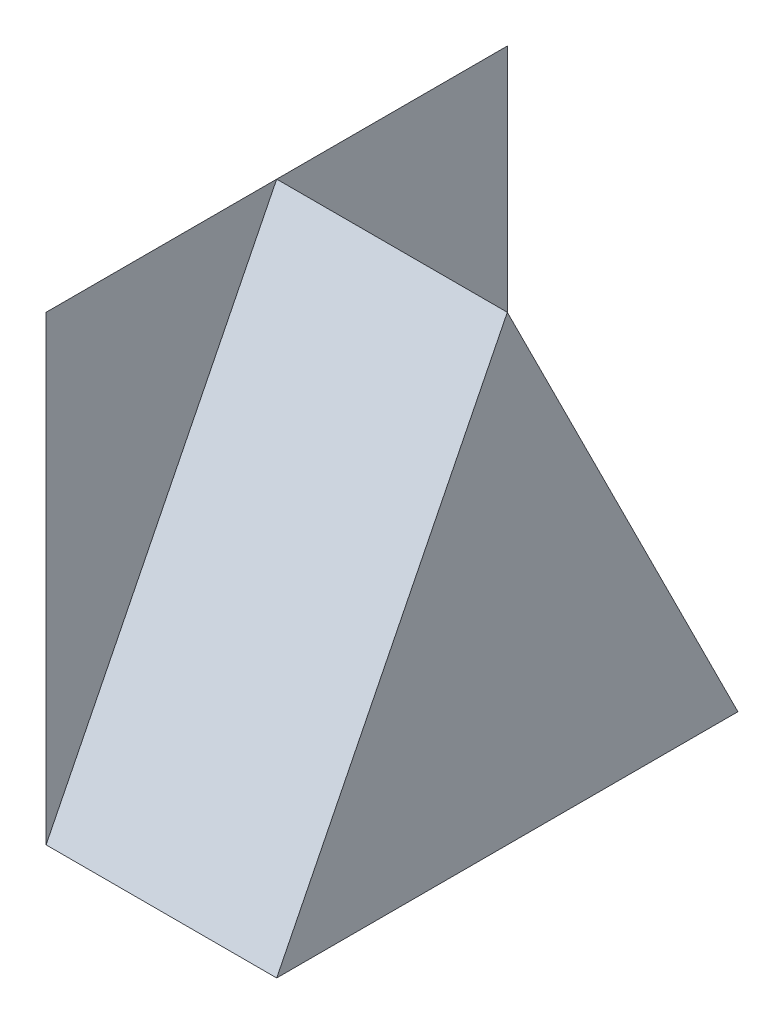
ISO-10303-21;
HEADER;
FILE_DESCRIPTION(('STEP AP214'),'2;1');
FILE_NAME('part.step','',(''),(''),'','','');
FILE_SCHEMA(('AUTOMOTIVE_DESIGN { 1 0 10303 214 1 1 1 1 }'));
ENDSEC;
DATA;
#1=APPLICATION_CONTEXT('core data for automotive mechanical design processes');
#2=APPLICATION_PROTOCOL_DEFINITION('international standard','automotive_design',2000,#1);
#3=PRODUCT_CONTEXT('',#1,'mechanical');
#4=PRODUCT('Part','Part','',(#3));
#5=PRODUCT_RELATED_PRODUCT_CATEGORY('part','',(#4));
#6=PRODUCT_DEFINITION_FORMATION('','',#4);
#7=PRODUCT_DEFINITION_CONTEXT('part definition',#1,'design');
#8=PRODUCT_DEFINITION('design','',#6,#7);
#9=PRODUCT_DEFINITION_SHAPE('','',#8);
#10=(LENGTH_UNIT() NAMED_UNIT(*) SI_UNIT(.MILLI.,.METRE.));
#11=(NAMED_UNIT(*) PLANE_ANGLE_UNIT() SI_UNIT($,.RADIAN.));
#12=(NAMED_UNIT(*) SI_UNIT($,.STERADIAN.) SOLID_ANGLE_UNIT());
#13=UNCERTAINTY_MEASURE_WITH_UNIT(LENGTH_MEASURE(1.E-05),#10,'distance_accuracy_value','');
#14=(GEOMETRIC_REPRESENTATION_CONTEXT(3) GLOBAL_UNCERTAINTY_ASSIGNED_CONTEXT((#13)) GLOBAL_UNIT_ASSIGNED_CONTEXT((#10,
#11,#12)) REPRESENTATION_CONTEXT('',''));
#15=CARTESIAN_POINT('',(0.,0.,0.));
#16=DIRECTION('',(0.,0.,1.));
#17=DIRECTION('',(1.,0.,0.));
#18=AXIS2_PLACEMENT_3D('',#15,#16,#17);
#19=CARTESIAN_POINT('',(0.,0.,40.));
#20=DIRECTION('',(0.,1.,0.));
#21=DIRECTION('',(0.,0.,1.));
#22=AXIS2_PLACEMENT_3D('',#19,#20,#21);
#23=PLANE('',#22);
#24=DIRECTION('',(-0.707106781186548,0.,-0.707106781186548));
#25=VECTOR('',#24,1.);
#26=CARTESIAN_POINT('',(-10.,0.,10.));
#27=LINE('',#26,#25);
#28=CARTESIAN_POINT('',(20.,0.,40.));
#29=VERTEX_POINT('',#28);
#30=CARTESIAN_POINT('',(0.000100000000001141,0.,20.0001));
#31=VERTEX_POINT('',#30);
#32=EDGE_CURVE('E147',#29,#31,#27,.T.);
#33=ORIENTED_EDGE('',*,*,#32,.T.);
#34=DIRECTION('',(-1.,0.,0.));
#35=VECTOR('',#34,1.);
#36=CARTESIAN_POINT('',(0.,0.,20.0001));
#37=LINE('',#36,#35);
#38=CARTESIAN_POINT('',(21.9656812601414,0.,20.0001));
#39=VERTEX_POINT('',#38);
#40=EDGE_CURVE('E49',#39,#31,#37,.T.);
#41=ORIENTED_EDGE('',*,*,#40,.F.);
#42=DIRECTION('',(0.,0.,1.));
#43=VECTOR('',#42,1.);
#44=CARTESIAN_POINT('',(21.9656812601414,0.,20.));
#45=LINE('',#44,#43);
#46=CARTESIAN_POINT('',(21.9656812601414,0.,20.));
#47=VERTEX_POINT('',#46);
#48=EDGE_CURVE('E130',#47,#39,#45,.T.);
#49=ORIENTED_EDGE('',*,*,#48,.F.);
#50=DIRECTION('',(1.,0.,0.));
#51=VECTOR('',#50,1.);
#52=CARTESIAN_POINT('',(0.,0.,20.));
#53=LINE('',#52,#51);
#54=CARTESIAN_POINT('',(0.,0.,20.));
#55=VERTEX_POINT('',#54);
#56=EDGE_CURVE('E118',#55,#47,#53,.T.);
#57=ORIENTED_EDGE('',*,*,#56,.F.);
#58=DIRECTION('',(0.707106781186548,0.,-0.707106781186548));
#59=VECTOR('',#58,1.);
#60=CARTESIAN_POINT('',(10.,0.,10.));
#61=LINE('',#60,#59);
#62=CARTESIAN_POINT('',(20.,0.,0.));
#63=VERTEX_POINT('',#62);
#64=EDGE_CURVE('E160',#55,#63,#61,.T.);
#65=ORIENTED_EDGE('',*,*,#64,.T.);
#66=DIRECTION('',(1.,0.,0.));
#67=VECTOR('',#66,1.);
#68=CARTESIAN_POINT('',(0.,0.,0.));
#69=LINE('',#68,#67);
#70=CARTESIAN_POINT('',(40.,0.,0.));
#71=VERTEX_POINT('',#70);
#72=EDGE_CURVE('E169',#63,#71,#69,.T.);
#73=ORIENTED_EDGE('',*,*,#72,.T.);
#74=DIRECTION('',(0.,0.,-1.));
#75=VECTOR('',#74,1.);
#76=CARTESIAN_POINT('',(40.,0.,40.));
#77=LINE('',#76,#75);
#78=CARTESIAN_POINT('',(40.,0.,40.));
#79=VERTEX_POINT('',#78);
#80=EDGE_CURVE('E172',#79,#71,#77,.T.);
#81=ORIENTED_EDGE('',*,*,#80,.F.);
#82=DIRECTION('',(1.,0.,0.));
#83=VECTOR('',#82,1.);
#84=CARTESIAN_POINT('',(0.,0.,40.));
#85=LINE('',#84,#83);
#86=EDGE_CURVE('E170',#29,#79,#85,.T.);
#87=ORIENTED_EDGE('',*,*,#86,.F.);
#88=EDGE_LOOP('',(#33,#41,#49,#57,#65,#73,#81,#87));
#89=FACE_BOUND('',#88,.T.);
#90=ADVANCED_FACE('F35',(#89),#23,.F.);
#91=CARTESIAN_POINT('',(0.,0.,0.));
#92=DIRECTION('',(0.894427190999916,-0.447213595499958,0.));
#93=DIRECTION('',(0.447213595499958,0.894427190999916,0.));
#94=AXIS2_PLACEMENT_3D('',#91,#92,#93);
#95=PLANE('',#94);
#96=DIRECTION('',(0.,0.,1.));
#97=VECTOR('',#96,1.);
#98=CARTESIAN_POINT('',(0.0005,0.001,0.));
#99=LINE('',#98,#97);
#100=CARTESIAN_POINT('',(0.0005,0.001,20.));
#101=VERTEX_POINT('',#100);
#102=CARTESIAN_POINT('',(0.0005,0.001,20.0001));
#103=VERTEX_POINT('',#102);
#104=EDGE_CURVE('E12',#101,#103,#99,.T.);
#105=ORIENTED_EDGE('',*,*,#104,.T.);
#106=DIRECTION('',(-0.447213595499958,-0.894427190999916,0.));
#107=VECTOR('',#106,1.);
#108=CARTESIAN_POINT('',(0.,0.,20.0001));
#109=LINE('',#108,#107);
#110=CARTESIAN_POINT('',(9.99999999920335E-05,0.000199999999977128,20.0001));
#111=VERTEX_POINT('',#110);
#112=EDGE_CURVE('E136',#103,#111,#109,.T.);
#113=ORIENTED_EDGE('',*,*,#112,.T.);
#114=DIRECTION('',(-0.408248290463863,-0.816496580927726,-0.408248290463863));
#115=VECTOR('',#114,1.);
#116=CARTESIAN_POINT('',(-3.33333333333333,-6.66666666666667,16.6666666666667));
#117=LINE('',#116,#115);
#118=CARTESIAN_POINT('',(20.,40.,40.));
#119=VERTEX_POINT('',#118);
#120=EDGE_CURVE('E155',#119,#111,#117,.T.);
#121=ORIENTED_EDGE('',*,*,#120,.F.);
#122=DIRECTION('',(0.,0.,1.));
#123=VECTOR('',#122,1.);
#124=CARTESIAN_POINT('',(20.,40.,0.));
#125=LINE('',#124,#123);
#126=CARTESIAN_POINT('',(20.,40.,20.));
#127=VERTEX_POINT('',#126);
#128=EDGE_CURVE('E57',#127,#119,#125,.T.);
#129=ORIENTED_EDGE('',*,*,#128,.F.);
#130=DIRECTION('',(0.,0.,1.));
#131=VECTOR('',#130,1.);
#132=CARTESIAN_POINT('',(20.,40.,0.));
#133=LINE('',#132,#131);
#134=CARTESIAN_POINT('',(20.,40.,0.));
#135=VERTEX_POINT('',#134);
#136=EDGE_CURVE('E166',#135,#127,#133,.T.);
#137=ORIENTED_EDGE('',*,*,#136,.F.);
#138=DIRECTION('',(0.408248290463863,0.816496580927726,-0.408248290463863));
#139=VECTOR('',#138,1.);
#140=CARTESIAN_POINT('',(3.33333333333333,6.66666666666667,16.6666666666667));
#141=LINE('',#140,#139);
#142=EDGE_CURVE('E177',#55,#135,#141,.T.);
#143=ORIENTED_EDGE('',*,*,#142,.F.);
#144=DIRECTION('',(0.447213595499958,0.894427190999916,0.));
#145=VECTOR('',#144,1.);
#146=CARTESIAN_POINT('',(0.,0.,20.));
#147=LINE('',#146,#145);
#148=EDGE_CURVE('E133',#55,#101,#147,.T.);
#149=ORIENTED_EDGE('',*,*,#148,.T.);
#150=EDGE_LOOP('',(#105,#113,#121,#129,#137,#143,#149));
#151=FACE_BOUND('',#150,.T.);
#152=ADVANCED_FACE('F184',(#151),#95,.F.);
#153=CARTESIAN_POINT('',(40.,0.,40.));
#154=DIRECTION('',(-1.,0.,0.));
#155=DIRECTION('',(0.,0.,1.));
#156=AXIS2_PLACEMENT_3D('',#153,#154,#155);
#157=PLANE('',#156);
#158=ORIENTED_EDGE('',*,*,#80,.T.);
#159=DIRECTION('',(0.,-0.894427190999916,-0.447213595499958));
#160=VECTOR('',#159,1.);
#161=CARTESIAN_POINT('',(40.,0.,0.));
#162=LINE('',#161,#160);
#163=CARTESIAN_POINT('',(40.,40.,20.));
#164=VERTEX_POINT('',#163);
#165=EDGE_CURVE('E142',#164,#71,#162,.T.);
#166=ORIENTED_EDGE('',*,*,#165,.F.);
#167=DIRECTION('',(0.,0.894427190999916,-0.447213595499958));
#168=VECTOR('',#167,1.);
#169=CARTESIAN_POINT('',(40.,16.,32.));
#170=LINE('',#169,#168);
#171=EDGE_CURVE('E144',#79,#164,#170,.T.);
#172=ORIENTED_EDGE('',*,*,#171,.F.);
#173=EDGE_LOOP('',(#158,#166,#172));
#174=FACE_BOUND('',#173,.T.);
#175=ADVANCED_FACE('F200',(#174),#157,.F.);
#176=CARTESIAN_POINT('',(10.,40.,10.));
#177=DIRECTION('',(-0.707106781186548,0.,-0.707106781186548));
#178=DIRECTION('',(-0.707106781186548,0.,0.707106781186548));
#179=AXIS2_PLACEMENT_3D('',#176,#177,#178);
#180=PLANE('',#179);
#181=ORIENTED_EDGE('',*,*,#142,.T.);
#182=DIRECTION('',(0.,-1.,0.));
#183=VECTOR('',#182,1.);
#184=CARTESIAN_POINT('',(20.,40.,0.));
#185=LINE('',#184,#183);
#186=EDGE_CURVE('E163',#135,#63,#185,.T.);
#187=ORIENTED_EDGE('',*,*,#186,.T.);
#188=ORIENTED_EDGE('',*,*,#64,.F.);
#189=EDGE_LOOP('',(#181,#187,#188));
#190=FACE_BOUND('',#189,.T.);
#191=ADVANCED_FACE('F205',(#190),#180,.T.);
#192=CARTESIAN_POINT('',(-10.,40.,10.));
#193=DIRECTION('',(-0.707106781186548,0.,0.707106781186548));
#194=DIRECTION('',(0.707106781186548,0.,0.707106781186548));
#195=AXIS2_PLACEMENT_3D('',#192,#193,#194);
#196=PLANE('',#195);
#197=DIRECTION('',(0.,1.,0.));
#198=VECTOR('',#197,1.);
#199=CARTESIAN_POINT('',(9.99999999959367E-05,40.,20.0001));
#200=LINE('',#199,#198);
#201=EDGE_CURVE('E42',#31,#111,#200,.T.);
#202=ORIENTED_EDGE('',*,*,#201,.F.);
#203=ORIENTED_EDGE('',*,*,#32,.F.);
#204=DIRECTION('',(0.,-1.,0.));
#205=VECTOR('',#204,1.);
#206=CARTESIAN_POINT('',(20.,40.,40.));
#207=LINE('',#206,#205);
#208=EDGE_CURVE('E153',#119,#29,#207,.T.);
#209=ORIENTED_EDGE('',*,*,#208,.F.);
#210=ORIENTED_EDGE('',*,*,#120,.T.);
#211=EDGE_LOOP('',(#202,#203,#209,#210));
#212=FACE_BOUND('',#211,.T.);
#213=ADVANCED_FACE('F185',(#212),#196,.T.);
#214=CARTESIAN_POINT('',(20.,16.,32.));
#215=DIRECTION('',(0.,-0.447213595499958,-0.894427190999916));
#216=DIRECTION('',(0.,0.894427190999916,-0.447213595499958));
#217=AXIS2_PLACEMENT_3D('',#214,#215,#216);
#218=PLANE('',#217);
#219=ORIENTED_EDGE('',*,*,#171,.T.);
#220=DIRECTION('',(1.,0.,0.));
#221=VECTOR('',#220,1.);
#222=CARTESIAN_POINT('',(20.,40.,20.));
#223=LINE('',#222,#221);
#224=EDGE_CURVE('E145',#127,#164,#223,.T.);
#225=ORIENTED_EDGE('',*,*,#224,.F.);
#226=DIRECTION('',(0.,0.894427190999916,-0.447213595499958));
#227=VECTOR('',#226,1.);
#228=CARTESIAN_POINT('',(20.,16.,32.));
#229=LINE('',#228,#227);
#230=EDGE_CURVE('E148',#29,#127,#229,.T.);
#231=ORIENTED_EDGE('',*,*,#230,.F.);
#232=ORIENTED_EDGE('',*,*,#86,.T.);
#233=EDGE_LOOP('',(#219,#225,#231,#232));
#234=FACE_BOUND('',#233,.T.);
#235=ADVANCED_FACE('F194',(#234),#218,.F.);
#236=CARTESIAN_POINT('',(20.,0.,0.));
#237=DIRECTION('',(1.,0.,0.));
#238=DIRECTION('',(0.,0.,-1.));
#239=AXIS2_PLACEMENT_3D('',#236,#237,#238);
#240=PLANE('',#239);
#241=ORIENTED_EDGE('',*,*,#208,.T.);
#242=ORIENTED_EDGE('',*,*,#230,.T.);
#243=ORIENTED_EDGE('',*,*,#128,.T.);
#244=EDGE_LOOP('',(#241,#242,#243));
#245=FACE_BOUND('',#244,.T.);
#246=ADVANCED_FACE('F187',(#245),#240,.T.);
#247=CARTESIAN_POINT('',(20.,0.,0.));
#248=DIRECTION('',(0.,-0.447213595499958,0.894427190999916));
#249=DIRECTION('',(0.,-0.894427190999916,-0.447213595499958));
#250=AXIS2_PLACEMENT_3D('',#247,#248,#249);
#251=PLANE('',#250);
#252=ORIENTED_EDGE('',*,*,#165,.T.);
#253=ORIENTED_EDGE('',*,*,#72,.F.);
#254=DIRECTION('',(0.,-0.894427190999916,-0.447213595499958));
#255=VECTOR('',#254,1.);
#256=CARTESIAN_POINT('',(20.,0.,0.));
#257=LINE('',#256,#255);
#258=EDGE_CURVE('E139',#127,#63,#257,.T.);
#259=ORIENTED_EDGE('',*,*,#258,.F.);
#260=ORIENTED_EDGE('',*,*,#224,.T.);
#261=EDGE_LOOP('',(#252,#253,#259,#260));
#262=FACE_BOUND('',#261,.T.);
#263=ADVANCED_FACE('F198',(#262),#251,.F.);
#264=CARTESIAN_POINT('',(20.,0.,0.));
#265=DIRECTION('',(1.,0.,0.));
#266=DIRECTION('',(0.,0.,-1.));
#267=AXIS2_PLACEMENT_3D('',#264,#265,#266);
#268=PLANE('',#267);
#269=ORIENTED_EDGE('',*,*,#136,.T.);
#270=ORIENTED_EDGE('',*,*,#258,.T.);
#271=ORIENTED_EDGE('',*,*,#186,.F.);
#272=EDGE_LOOP('',(#269,#270,#271));
#273=FACE_BOUND('',#272,.T.);
#274=ADVANCED_FACE('F193',(#273),#268,.T.);
#275=CARTESIAN_POINT('',(0.,0.001,0.));
#276=DIRECTION('',(0.,1.,0.));
#277=DIRECTION('',(0.,0.,1.));
#278=AXIS2_PLACEMENT_3D('',#275,#276,#277);
#279=PLANE('',#278);
#280=DIRECTION('',(1.,0.,0.));
#281=VECTOR('',#280,1.);
#282=CARTESIAN_POINT('',(0.,0.001,20.));
#283=LINE('',#282,#281);
#284=CARTESIAN_POINT('',(21.9656812601414,0.001,20.));
#285=VERTEX_POINT('',#284);
#286=EDGE_CURVE('E104',#101,#285,#283,.T.);
#287=ORIENTED_EDGE('',*,*,#286,.T.);
#288=DIRECTION('',(0.,0.,1.));
#289=VECTOR('',#288,1.);
#290=CARTESIAN_POINT('',(21.9656812601414,0.001,20.));
#291=LINE('',#290,#289);
#292=CARTESIAN_POINT('',(21.9656812601414,0.001,20.0001));
#293=VERTEX_POINT('',#292);
#294=EDGE_CURVE('E109',#285,#293,#291,.T.);
#295=ORIENTED_EDGE('',*,*,#294,.T.);
#296=DIRECTION('',(-1.,0.,0.));
#297=VECTOR('',#296,1.);
#298=CARTESIAN_POINT('',(0.,0.001,20.0001));
#299=LINE('',#298,#297);
#300=EDGE_CURVE('E123',#293,#103,#299,.T.);
#301=ORIENTED_EDGE('',*,*,#300,.T.);
#302=ORIENTED_EDGE('',*,*,#104,.F.);
#303=EDGE_LOOP('',(#287,#295,#301,#302));
#304=FACE_BOUND('',#303,.T.);
#305=ADVANCED_FACE('F106',(#304),#279,.F.);
#306=CARTESIAN_POINT('',(0.,0.001,20.0001));
#307=DIRECTION('',(0.,0.,1.));
#308=DIRECTION('',(1.,0.,0.));
#309=AXIS2_PLACEMENT_3D('',#306,#307,#308);
#310=PLANE('',#309);
#311=ORIENTED_EDGE('',*,*,#300,.F.);
#312=DIRECTION('',(0.,-1.,0.));
#313=VECTOR('',#312,1.);
#314=CARTESIAN_POINT('',(21.9656812601414,0.001,20.0001));
#315=LINE('',#314,#313);
#316=EDGE_CURVE('E122',#293,#39,#315,.T.);
#317=ORIENTED_EDGE('',*,*,#316,.T.);
#318=ORIENTED_EDGE('',*,*,#40,.T.);
#319=ORIENTED_EDGE('',*,*,#201,.T.);
#320=ORIENTED_EDGE('',*,*,#112,.F.);
#321=EDGE_LOOP('',(#311,#317,#318,#319,#320));
#322=FACE_BOUND('',#321,.T.);
#323=ADVANCED_FACE('F179',(#322),#310,.F.);
#324=CARTESIAN_POINT('',(0.,0.001,20.));
#325=DIRECTION('',(0.,0.,-1.));
#326=DIRECTION('',(-1.,0.,0.));
#327=AXIS2_PLACEMENT_3D('',#324,#325,#326);
#328=PLANE('',#327);
#329=ORIENTED_EDGE('',*,*,#56,.T.);
#330=DIRECTION('',(0.,-1.,0.));
#331=VECTOR('',#330,1.);
#332=CARTESIAN_POINT('',(21.9656812601414,0.001,20.));
#333=LINE('',#332,#331);
#334=EDGE_CURVE('E115',#285,#47,#333,.T.);
#335=ORIENTED_EDGE('',*,*,#334,.F.);
#336=ORIENTED_EDGE('',*,*,#286,.F.);
#337=ORIENTED_EDGE('',*,*,#148,.F.);
#338=EDGE_LOOP('',(#329,#335,#336,#337));
#339=FACE_BOUND('',#338,.T.);
#340=ADVANCED_FACE('F116',(#339),#328,.F.);
#341=CARTESIAN_POINT('',(21.9656812601414,0.001,20.));
#342=DIRECTION('',(1.,0.,0.));
#343=DIRECTION('',(0.,0.,-1.));
#344=AXIS2_PLACEMENT_3D('',#341,#342,#343);
#345=PLANE('',#344);
#346=ORIENTED_EDGE('',*,*,#48,.T.);
#347=ORIENTED_EDGE('',*,*,#316,.F.);
#348=ORIENTED_EDGE('',*,*,#294,.F.);
#349=ORIENTED_EDGE('',*,*,#334,.T.);
#350=EDGE_LOOP('',(#346,#347,#348,#349));
#351=FACE_BOUND('',#350,.T.);
#352=ADVANCED_FACE('F125',(#351),#345,.F.);
#353=CLOSED_SHELL('',(#90,#152,#175,#191,#213,#235,#246,#263,#274,#305,#323,#340,#352));
#354=MANIFOLD_SOLID_BREP('B2',#353);
#355=ADVANCED_BREP_SHAPE_REPRESENTATION('',(#18,#354),#14);
#356=SHAPE_DEFINITION_REPRESENTATION(#9,#355);
ENDSEC;
END-ISO-10303-21;
